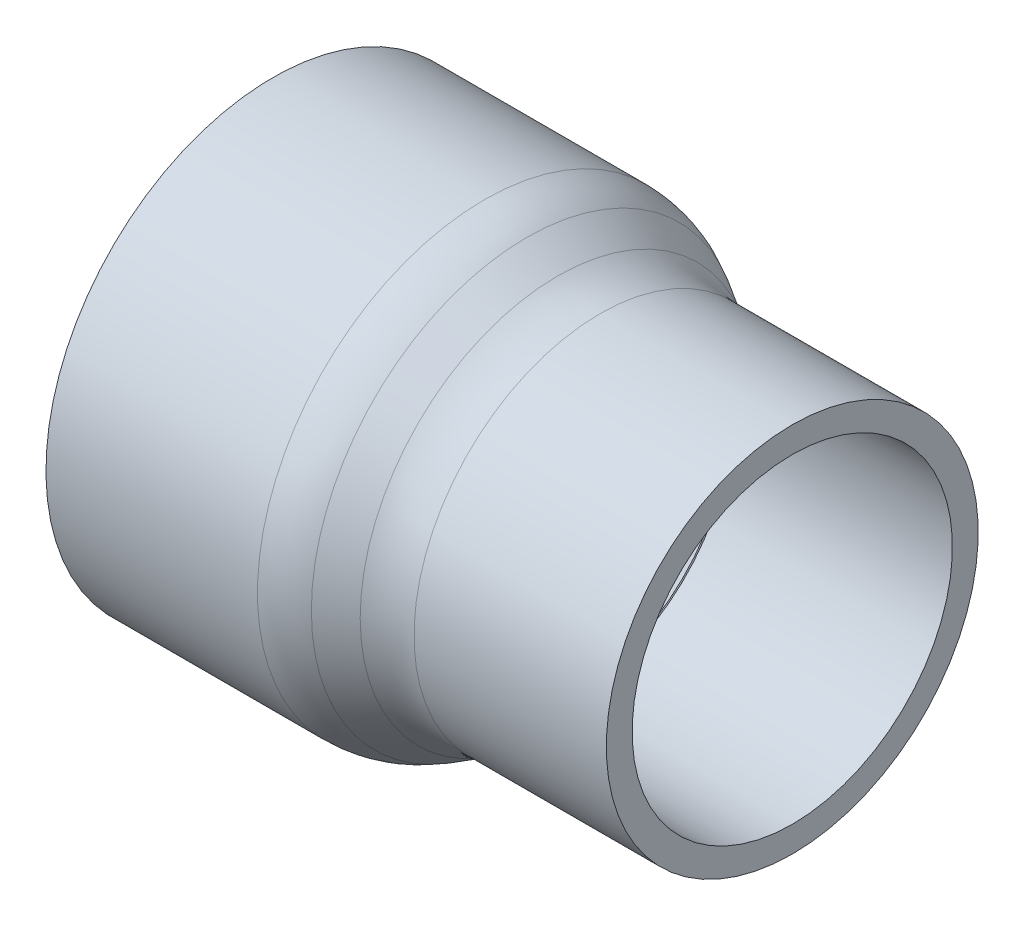
ISO-10303-21;
HEADER;
FILE_DESCRIPTION(('STEP AP214'),'2;1');
FILE_NAME('part.step','',(''),(''),'','','');
FILE_SCHEMA(('AUTOMOTIVE_DESIGN { 1 0 10303 214 1 1 1 1 }'));
ENDSEC;
DATA;
#1=APPLICATION_CONTEXT('core data for automotive mechanical design processes');
#2=APPLICATION_PROTOCOL_DEFINITION('international standard','automotive_design',2000,#1);
#3=PRODUCT_CONTEXT('',#1,'mechanical');
#4=PRODUCT('Part','Part','',(#3));
#5=PRODUCT_RELATED_PRODUCT_CATEGORY('part','',(#4));
#6=PRODUCT_DEFINITION_FORMATION('','',#4);
#7=PRODUCT_DEFINITION_CONTEXT('part definition',#1,'design');
#8=PRODUCT_DEFINITION('design','',#6,#7);
#9=PRODUCT_DEFINITION_SHAPE('','',#8);
#10=(LENGTH_UNIT() NAMED_UNIT(*) SI_UNIT(.MILLI.,.METRE.));
#11=(NAMED_UNIT(*) PLANE_ANGLE_UNIT() SI_UNIT($,.RADIAN.));
#12=(NAMED_UNIT(*) SI_UNIT($,.STERADIAN.) SOLID_ANGLE_UNIT());
#13=UNCERTAINTY_MEASURE_WITH_UNIT(LENGTH_MEASURE(1.E-05),#10,'distance_accuracy_value','');
#14=(GEOMETRIC_REPRESENTATION_CONTEXT(3) GLOBAL_UNCERTAINTY_ASSIGNED_CONTEXT((#13)) GLOBAL_UNIT_ASSIGNED_CONTEXT((#10,
#11,#12)) REPRESENTATION_CONTEXT('',''));
#15=CARTESIAN_POINT('',(0.,0.,0.));
#16=DIRECTION('',(0.,0.,1.));
#17=DIRECTION('',(1.,0.,0.));
#18=AXIS2_PLACEMENT_3D('',#15,#16,#17);
#19=CARTESIAN_POINT('',(-39.37,0.,0.));
#20=DIRECTION('',(-1.,0.,0.));
#21=DIRECTION('',(0.,-1.,0.));
#22=AXIS2_PLACEMENT_3D('',#19,#20,#21);
#23=CYLINDRICAL_SURFACE('',#22,34.417);
#24=CARTESIAN_POINT('',(-7.29610299690509,0.,0.));
#25=DIRECTION('',(1.,0.,0.));
#26=DIRECTION('',(0.,1.,0.));
#27=AXIS2_PLACEMENT_3D('',#24,#25,#26);
#28=CIRCLE('',#27,34.417);
#29=CARTESIAN_POINT('',(-7.29610299690508,34.417,0.));
#30=VERTEX_POINT('',#29);
#31=EDGE_CURVE('E43',#30,#30,#28,.F.);
#32=ORIENTED_EDGE('',*,*,#31,.T.);
#33=EDGE_LOOP('',(#32));
#34=FACE_BOUND('',#33,.T.);
#35=CARTESIAN_POINT('',(-39.37,0.,0.));
#36=DIRECTION('',(-1.,0.,0.));
#37=DIRECTION('',(0.,-1.,0.));
#38=AXIS2_PLACEMENT_3D('',#35,#36,#37);
#39=CIRCLE('',#38,34.417);
#40=CARTESIAN_POINT('',(-39.37,-34.417,0.));
#41=VERTEX_POINT('',#40);
#42=EDGE_CURVE('E48',#41,#41,#39,.T.);
#43=ORIENTED_EDGE('',*,*,#42,.F.);
#44=EDGE_LOOP('',(#43));
#45=FACE_BOUND('',#44,.T.);
#46=ADVANCED_FACE('F28',(#34,#45),#23,.T.);
#47=CARTESIAN_POINT('',(-39.37,-34.417,0.));
#48=DIRECTION('',(-1.,0.,0.));
#49=DIRECTION('',(0.,-1.,0.));
#50=AXIS2_PLACEMENT_3D('',#47,#48,#49);
#51=PLANE('',#50);
#52=ORIENTED_EDGE('',*,*,#42,.T.);
#53=EDGE_LOOP('',(#52));
#54=FACE_BOUND('',#53,.T.);
#55=CARTESIAN_POINT('',(-39.37,0.,0.));
#56=DIRECTION('',(-1.,0.,0.));
#57=DIRECTION('',(0.,-1.,0.));
#58=AXIS2_PLACEMENT_3D('',#55,#56,#57);
#59=CIRCLE('',#58,30.3149);
#60=CARTESIAN_POINT('',(-39.37,-30.3149,0.));
#61=VERTEX_POINT('',#60);
#62=EDGE_CURVE('E51',#61,#61,#59,.T.);
#63=ORIENTED_EDGE('',*,*,#62,.F.);
#64=EDGE_LOOP('',(#63));
#65=FACE_BOUND('',#64,.T.);
#66=ADVANCED_FACE('F87',(#54,#65),#51,.T.);
#67=CARTESIAN_POINT('',(-4.572,0.,0.));
#68=DIRECTION('',(-1.,0.,0.));
#69=DIRECTION('',(0.,-1.,0.));
#70=AXIS2_PLACEMENT_3D('',#67,#68,#69);
#71=CONICAL_SURFACE('',#70,30.0863,0.00656924856536302);
#72=ORIENTED_EDGE('',*,*,#62,.T.);
#73=EDGE_LOOP('',(#72));
#74=FACE_BOUND('',#73,.T.);
#75=CARTESIAN_POINT('',(-4.572,0.,0.));
#76=DIRECTION('',(-1.,0.,0.));
#77=DIRECTION('',(0.,-1.,0.));
#78=AXIS2_PLACEMENT_3D('',#75,#76,#77);
#79=CIRCLE('',#78,30.0863);
#80=CARTESIAN_POINT('',(-4.57200000000001,-30.0863,0.));
#81=VERTEX_POINT('',#80);
#82=EDGE_CURVE('E54',#81,#81,#79,.T.);
#83=ORIENTED_EDGE('',*,*,#82,.F.);
#84=EDGE_LOOP('',(#83));
#85=FACE_BOUND('',#84,.T.);
#86=ADVANCED_FACE('F93',(#74,#85),#71,.F.);
#87=CARTESIAN_POINT('',(5.99981745473317,0.,0.));
#88=DIRECTION('',(-1.,0.,0.));
#89=DIRECTION('',(0.,-1.,0.));
#90=AXIS2_PLACEMENT_3D('',#87,#88,#89);
#91=CONICAL_SURFACE('',#90,23.8897059347466,0.530168024163663);
#92=ORIENTED_EDGE('',*,*,#82,.T.);
#93=EDGE_LOOP('',(#92));
#94=FACE_BOUND('',#93,.T.);
#95=CARTESIAN_POINT('',(5.99981745473317,0.,0.));
#96=DIRECTION('',(-1.,0.,0.));
#97=DIRECTION('',(0.,-1.,0.));
#98=AXIS2_PLACEMENT_3D('',#95,#96,#97);
#99=CIRCLE('',#98,23.8897059347466);
#100=CARTESIAN_POINT('',(5.99981745473317,-23.8897059347466,0.));
#101=VERTEX_POINT('',#100);
#102=EDGE_CURVE('E57',#101,#101,#99,.T.);
#103=ORIENTED_EDGE('',*,*,#102,.F.);
#104=EDGE_LOOP('',(#103));
#105=FACE_BOUND('',#104,.T.);
#106=ADVANCED_FACE('F142',(#94,#105),#91,.F.);
#107=CARTESIAN_POINT('',(6.09600000000001,0.,0.));
#108=DIRECTION('',(1.,0.,0.));
#109=DIRECTION('',(0.,1.,0.));
#110=AXIS2_PLACEMENT_3D('',#107,#108,#109);
#111=CONICAL_SURFACE('',#110,24.0538,1.04062830263124);
#112=ORIENTED_EDGE('',*,*,#102,.T.);
#113=EDGE_LOOP('',(#112));
#114=FACE_BOUND('',#113,.T.);
#115=CARTESIAN_POINT('',(6.09600000000001,0.,0.));
#116=DIRECTION('',(-1.,0.,0.));
#117=DIRECTION('',(0.,-1.,0.));
#118=AXIS2_PLACEMENT_3D('',#115,#116,#117);
#119=CIRCLE('',#118,24.0538);
#120=CARTESIAN_POINT('',(6.09600000000001,-24.0538,0.));
#121=VERTEX_POINT('',#120);
#122=EDGE_CURVE('E60',#121,#121,#119,.T.);
#123=ORIENTED_EDGE('',*,*,#122,.F.);
#124=EDGE_LOOP('',(#123));
#125=FACE_BOUND('',#124,.T.);
#126=ADVANCED_FACE('F83',(#114,#125),#111,.F.);
#127=CARTESIAN_POINT('',(39.37,0.,0.));
#128=DIRECTION('',(1.,0.,0.));
#129=DIRECTION('',(0.,1.,0.));
#130=AXIS2_PLACEMENT_3D('',#127,#128,#129);
#131=CONICAL_SURFACE('',#130,24.2824,0.00687012091898427);
#132=ORIENTED_EDGE('',*,*,#122,.T.);
#133=EDGE_LOOP('',(#132));
#134=FACE_BOUND('',#133,.T.);
#135=CARTESIAN_POINT('',(39.37,0.,0.));
#136=DIRECTION('',(-1.,0.,0.));
#137=DIRECTION('',(0.,-1.,0.));
#138=AXIS2_PLACEMENT_3D('',#135,#136,#137);
#139=CIRCLE('',#138,24.2824);
#140=CARTESIAN_POINT('',(39.37,-24.2824,0.));
#141=VERTEX_POINT('',#140);
#142=EDGE_CURVE('E63',#141,#141,#139,.T.);
#143=ORIENTED_EDGE('',*,*,#142,.F.);
#144=EDGE_LOOP('',(#143));
#145=FACE_BOUND('',#144,.T.);
#146=ADVANCED_FACE('F74',(#134,#145),#131,.F.);
#147=CARTESIAN_POINT('',(39.37,-24.2824,0.));
#148=DIRECTION('',(1.,0.,0.));
#149=DIRECTION('',(0.,1.,0.));
#150=AXIS2_PLACEMENT_3D('',#147,#148,#149);
#151=PLANE('',#150);
#152=ORIENTED_EDGE('',*,*,#142,.T.);
#153=EDGE_LOOP('',(#152));
#154=FACE_BOUND('',#153,.T.);
#155=CARTESIAN_POINT('',(39.37,0.,0.));
#156=DIRECTION('',(-1.,0.,0.));
#157=DIRECTION('',(0.,-1.,0.));
#158=AXIS2_PLACEMENT_3D('',#155,#156,#157);
#159=CIRCLE('',#158,28.194);
#160=CARTESIAN_POINT('',(39.37,-28.194,0.));
#161=VERTEX_POINT('',#160);
#162=EDGE_CURVE('E66',#161,#161,#159,.T.);
#163=ORIENTED_EDGE('',*,*,#162,.F.);
#164=EDGE_LOOP('',(#163));
#165=FACE_BOUND('',#164,.T.);
#166=ADVANCED_FACE('F72',(#154,#165),#151,.T.);
#167=CARTESIAN_POINT('',(-39.37,0.,0.));
#168=DIRECTION('',(-1.,0.,0.));
#169=DIRECTION('',(0.,-1.,0.));
#170=AXIS2_PLACEMENT_3D('',#167,#168,#169);
#171=CYLINDRICAL_SURFACE('',#170,28.194);
#172=CARTESIAN_POINT('',(10.2161728069211,0.,0.));
#173=DIRECTION('',(-1.,0.,0.));
#174=DIRECTION('',(0.,-1.,0.));
#175=AXIS2_PLACEMENT_3D('',#172,#173,#174);
#176=CIRCLE('',#175,28.194);
#177=CARTESIAN_POINT('',(10.2161728069211,-28.194,0.));
#178=VERTEX_POINT('',#177);
#179=EDGE_CURVE('E10',#178,#178,#176,.F.);
#180=ORIENTED_EDGE('',*,*,#179,.T.);
#181=EDGE_LOOP('',(#180));
#182=FACE_BOUND('',#181,.T.);
#183=ORIENTED_EDGE('',*,*,#162,.T.);
#184=EDGE_LOOP('',(#183));
#185=FACE_BOUND('',#184,.T.);
#186=ADVANCED_FACE('F70',(#182,#185),#171,.T.);
#187=CARTESIAN_POINT('',(-3.84839899658513,0.,0.));
#188=DIRECTION('',(-1.,0.,0.));
#189=DIRECTION('',(0.,-1.,0.));
#190=AXIS2_PLACEMENT_3D('',#187,#188,#189);
#191=CONICAL_SURFACE('',#190,34.417,0.530168024163664);
#192=CARTESIAN_POINT('',(-0.873988504298546,0.,0.));
#193=DIRECTION('',(1.,0.,0.));
#194=DIRECTION('',(0.,1.,0.));
#195=AXIS2_PLACEMENT_3D('',#192,#193,#194);
#196=CIRCLE('',#195,32.6735708797896);
#197=CARTESIAN_POINT('',(-0.873988504298539,32.6735708797896,0.));
#198=VERTEX_POINT('',#197);
#199=EDGE_CURVE('E35',#198,#198,#196,.T.);
#200=ORIENTED_EDGE('',*,*,#199,.T.);
#201=EDGE_LOOP('',(#200));
#202=FACE_BOUND('',#201,.T.);
#203=CARTESIAN_POINT('',(3.79405831431457,0.,0.));
#204=DIRECTION('',(-1.,0.,0.));
#205=DIRECTION('',(0.,-1.,0.));
#206=AXIS2_PLACEMENT_3D('',#203,#204,#205);
#207=CIRCLE('',#206,29.9374291202104);
#208=CARTESIAN_POINT('',(3.79405831431457,-29.9374291202104,0.));
#209=VERTEX_POINT('',#208);
#210=EDGE_CURVE('E39',#209,#209,#207,.T.);
#211=ORIENTED_EDGE('',*,*,#210,.T.);
#212=EDGE_LOOP('',(#211));
#213=FACE_BOUND('',#212,.T.);
#214=ADVANCED_FACE('F81',(#202,#213),#191,.T.);
#215=CARTESIAN_POINT('',(-7.29610299690509,0.,0.));
#216=DIRECTION('',(1.,0.,0.));
#217=DIRECTION('',(0.,1.,0.));
#218=AXIS2_PLACEMENT_3D('',#215,#216,#217);
#219=TOROIDAL_SURFACE('',#218,21.717,12.7);
#220=ORIENTED_EDGE('',*,*,#199,.F.);
#221=EDGE_LOOP('',(#220));
#222=FACE_BOUND('',#221,.T.);
#223=ORIENTED_EDGE('',*,*,#31,.F.);
#224=EDGE_LOOP('',(#223));
#225=FACE_BOUND('',#224,.T.);
#226=ADVANCED_FACE('F98',(#222,#225),#219,.T.);
#227=CARTESIAN_POINT('',(10.2161728069211,0.,0.));
#228=DIRECTION('',(-1.,0.,0.));
#229=DIRECTION('',(0.,-1.,0.));
#230=AXIS2_PLACEMENT_3D('',#227,#228,#229);
#231=TOROIDAL_SURFACE('',#230,40.894,12.7);
#232=ORIENTED_EDGE('',*,*,#179,.F.);
#233=EDGE_LOOP('',(#232));
#234=FACE_BOUND('',#233,.T.);
#235=ORIENTED_EDGE('',*,*,#210,.F.);
#236=EDGE_LOOP('',(#235));
#237=FACE_BOUND('',#236,.T.);
#238=ADVANCED_FACE('F30',(#234,#237),#231,.F.);
#239=CLOSED_SHELL('',(#46,#66,#86,#106,#126,#146,#166,#186,#214,#226,#238));
#240=MANIFOLD_SOLID_BREP('B2',#239);
#241=ADVANCED_BREP_SHAPE_REPRESENTATION('',(#18,#240),#14);
#242=SHAPE_DEFINITION_REPRESENTATION(#9,#241);
ENDSEC;
END-ISO-10303-21;
